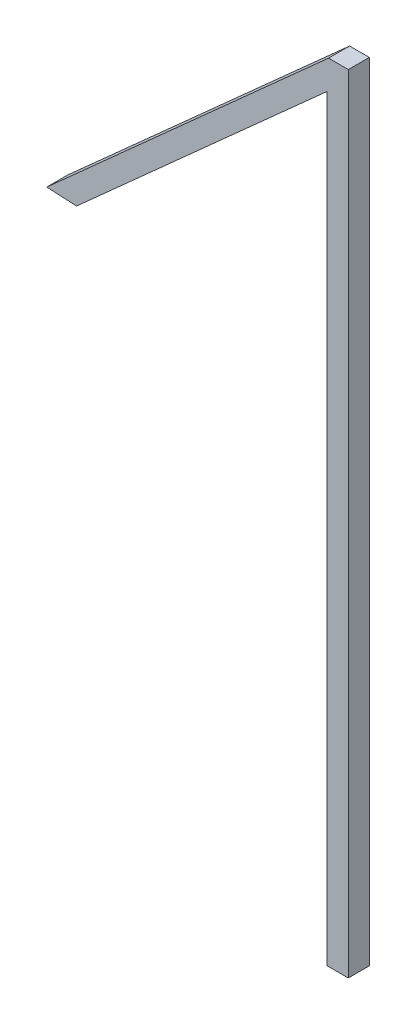
ISO-10303-21;
HEADER;
FILE_DESCRIPTION(('STEP AP214'),'2;1');
FILE_NAME('part.step','',(''),(''),'','','');
FILE_SCHEMA(('AUTOMOTIVE_DESIGN { 1 0 10303 214 1 1 1 1 }'));
ENDSEC;
DATA;
#1=APPLICATION_CONTEXT('core data for automotive mechanical design processes');
#2=APPLICATION_PROTOCOL_DEFINITION('international standard','automotive_design',2000,#1);
#3=PRODUCT_CONTEXT('',#1,'mechanical');
#4=PRODUCT('Part','Part','',(#3));
#5=PRODUCT_RELATED_PRODUCT_CATEGORY('part','',(#4));
#6=PRODUCT_DEFINITION_FORMATION('','',#4);
#7=PRODUCT_DEFINITION_CONTEXT('part definition',#1,'design');
#8=PRODUCT_DEFINITION('design','',#6,#7);
#9=PRODUCT_DEFINITION_SHAPE('','',#8);
#10=(LENGTH_UNIT() NAMED_UNIT(*) SI_UNIT(.MILLI.,.METRE.));
#11=(NAMED_UNIT(*) PLANE_ANGLE_UNIT() SI_UNIT($,.RADIAN.));
#12=(NAMED_UNIT(*) SI_UNIT($,.STERADIAN.) SOLID_ANGLE_UNIT());
#13=UNCERTAINTY_MEASURE_WITH_UNIT(LENGTH_MEASURE(1.E-05),#10,'distance_accuracy_value','');
#14=(GEOMETRIC_REPRESENTATION_CONTEXT(3) GLOBAL_UNCERTAINTY_ASSIGNED_CONTEXT((#13)) GLOBAL_UNIT_ASSIGNED_CONTEXT((#10,
#11,#12)) REPRESENTATION_CONTEXT('',''));
#15=CARTESIAN_POINT('',(0.,0.,0.));
#16=DIRECTION('',(0.,0.,1.));
#17=DIRECTION('',(1.,0.,0.));
#18=AXIS2_PLACEMENT_3D('',#15,#16,#17);
#19=CARTESIAN_POINT('',(0.,19.3962732825144,0.5));
#20=DIRECTION('',(0.0488801864381727,0.998804649255183,0.));
#21=DIRECTION('',(-0.998804649255183,0.0488801864381727,0.));
#22=AXIS2_PLACEMENT_3D('',#19,#20,#21);
#23=PLANE('',#22);
#24=DIRECTION('',(0.998804649255183,-0.0488801864381727,0.));
#25=VECTOR('',#24,1.);
#26=CARTESIAN_POINT('',(0.,19.3962732825144,0.));
#27=LINE('',#26,#25);
#28=CARTESIAN_POINT('',(0.,19.3962732825144,0.));
#29=VERTEX_POINT('',#28);
#30=CARTESIAN_POINT('',(0.710413851692346,19.3615065625709,0.));
#31=VERTEX_POINT('',#30);
#32=EDGE_CURVE('E123',#29,#31,#27,.T.);
#33=ORIENTED_EDGE('',*,*,#32,.T.);
#34=DIRECTION('',(0.,0.,-1.));
#35=VECTOR('',#34,1.);
#36=CARTESIAN_POINT('',(0.710413851692346,19.3615065625709,0.5));
#37=LINE('',#36,#35);
#38=CARTESIAN_POINT('',(0.710413851692346,19.3615065625709,0.5));
#39=VERTEX_POINT('',#38);
#40=EDGE_CURVE('E11',#39,#31,#37,.T.);
#41=ORIENTED_EDGE('',*,*,#40,.F.);
#42=DIRECTION('',(0.998804649255183,-0.0488801864381727,0.));
#43=VECTOR('',#42,1.);
#44=CARTESIAN_POINT('',(0.,19.3962732825144,0.5));
#45=LINE('',#44,#43);
#46=CARTESIAN_POINT('',(0.,19.3962732825144,0.5));
#47=VERTEX_POINT('',#46);
#48=EDGE_CURVE('E135',#47,#39,#45,.T.);
#49=ORIENTED_EDGE('',*,*,#48,.F.);
#50=DIRECTION('',(0.,0.,-1.));
#51=VECTOR('',#50,1.);
#52=CARTESIAN_POINT('',(0.,19.3962732825144,0.5));
#53=LINE('',#52,#51);
#54=EDGE_CURVE('E119',#47,#29,#53,.T.);
#55=ORIENTED_EDGE('',*,*,#54,.T.);
#56=EDGE_LOOP('',(#33,#41,#49,#55));
#57=FACE_BOUND('',#56,.T.);
#58=ADVANCED_FACE('F33',(#57),#23,.F.);
#59=CARTESIAN_POINT('',(0.710413851692346,19.3615065625709,0.5));
#60=DIRECTION('',(-0.667369141114597,0.744727083895816,0.));
#61=DIRECTION('',(-0.744727083895816,-0.667369141114597,0.));
#62=AXIS2_PLACEMENT_3D('',#59,#60,#61);
#63=PLANE('',#62);
#64=DIRECTION('',(0.744727083895816,0.667369141114597,0.));
#65=VECTOR('',#64,1.);
#66=CARTESIAN_POINT('',(0.710413851692346,19.3615065625709,0.));
#67=LINE('',#66,#65);
#68=CARTESIAN_POINT('',(6.66823052285887,24.7004596914876,0.));
#69=VERTEX_POINT('',#68);
#70=EDGE_CURVE('E126',#31,#69,#67,.T.);
#71=ORIENTED_EDGE('',*,*,#70,.T.);
#72=DIRECTION('',(0.,0.,-1.));
#73=VECTOR('',#72,1.);
#74=CARTESIAN_POINT('',(6.66823052285887,24.7004596914876,0.5));
#75=LINE('',#74,#73);
#76=CARTESIAN_POINT('',(6.66823052285887,24.7004596914876,0.5));
#77=VERTEX_POINT('',#76);
#78=EDGE_CURVE('E41',#77,#69,#75,.T.);
#79=ORIENTED_EDGE('',*,*,#78,.F.);
#80=DIRECTION('',(0.744727083895816,0.667369141114597,0.));
#81=VECTOR('',#80,1.);
#82=CARTESIAN_POINT('',(0.710413851692346,19.3615065625709,0.5));
#83=LINE('',#82,#81);
#84=EDGE_CURVE('E89',#39,#77,#83,.T.);
#85=ORIENTED_EDGE('',*,*,#84,.F.);
#86=ORIENTED_EDGE('',*,*,#40,.T.);
#87=EDGE_LOOP('',(#71,#79,#85,#86));
#88=FACE_BOUND('',#87,.T.);
#89=ADVANCED_FACE('F160',(#88),#63,.F.);
#90=CARTESIAN_POINT('',(6.66823052285887,24.7004596914876,0.5));
#91=DIRECTION('',(1.,0.,0.));
#92=DIRECTION('',(0.,1.,0.));
#93=AXIS2_PLACEMENT_3D('',#90,#91,#92);
#94=PLANE('',#93);
#95=DIRECTION('',(0.,-1.,0.));
#96=VECTOR('',#95,1.);
#97=CARTESIAN_POINT('',(6.66823052285887,24.7004596914876,0.));
#98=LINE('',#97,#96);
#99=CARTESIAN_POINT('',(6.66823052285887,6.70045969148764,0.));
#100=VERTEX_POINT('',#99);
#101=EDGE_CURVE('E128',#69,#100,#98,.T.);
#102=ORIENTED_EDGE('',*,*,#101,.T.);
#103=DIRECTION('',(0.,0.,-1.));
#104=VECTOR('',#103,1.);
#105=CARTESIAN_POINT('',(6.66823052285887,6.70045969148764,0.5));
#106=LINE('',#105,#104);
#107=CARTESIAN_POINT('',(6.66823052285887,6.70045969148764,0.5));
#108=VERTEX_POINT('',#107);
#109=EDGE_CURVE('E139',#108,#100,#106,.T.);
#110=ORIENTED_EDGE('',*,*,#109,.F.);
#111=DIRECTION('',(0.,-1.,0.));
#112=VECTOR('',#111,1.);
#113=CARTESIAN_POINT('',(6.66823052285887,24.7004596914876,0.5));
#114=LINE('',#113,#112);
#115=EDGE_CURVE('E147',#77,#108,#114,.T.);
#116=ORIENTED_EDGE('',*,*,#115,.F.);
#117=ORIENTED_EDGE('',*,*,#78,.T.);
#118=EDGE_LOOP('',(#102,#110,#116,#117));
#119=FACE_BOUND('',#118,.T.);
#120=ADVANCED_FACE('F145',(#119),#94,.F.);
#121=CARTESIAN_POINT('',(6.66823052285887,6.70045969148764,0.5));
#122=DIRECTION('',(0.,1.,0.));
#123=DIRECTION('',(0.,0.,1.));
#124=AXIS2_PLACEMENT_3D('',#121,#122,#123);
#125=PLANE('',#124);
#126=DIRECTION('',(1.,0.,0.));
#127=VECTOR('',#126,1.);
#128=CARTESIAN_POINT('',(6.66823052285887,6.70045969148764,0.));
#129=LINE('',#128,#127);
#130=CARTESIAN_POINT('',(7.16823052285887,6.70045969148764,0.));
#131=VERTEX_POINT('',#130);
#132=EDGE_CURVE('E130',#100,#131,#129,.T.);
#133=ORIENTED_EDGE('',*,*,#132,.T.);
#134=DIRECTION('',(0.,0.,-1.));
#135=VECTOR('',#134,1.);
#136=CARTESIAN_POINT('',(7.16823052285887,6.70045969148764,0.5));
#137=LINE('',#136,#135);
#138=CARTESIAN_POINT('',(7.16823052285887,6.70045969148764,0.5));
#139=VERTEX_POINT('',#138);
#140=EDGE_CURVE('E114',#139,#131,#137,.T.);
#141=ORIENTED_EDGE('',*,*,#140,.F.);
#142=DIRECTION('',(1.,0.,0.));
#143=VECTOR('',#142,1.);
#144=CARTESIAN_POINT('',(6.66823052285887,6.70045969148764,0.5));
#145=LINE('',#144,#143);
#146=EDGE_CURVE('E105',#108,#139,#145,.T.);
#147=ORIENTED_EDGE('',*,*,#146,.F.);
#148=ORIENTED_EDGE('',*,*,#109,.T.);
#149=EDGE_LOOP('',(#133,#141,#147,#148));
#150=FACE_BOUND('',#149,.T.);
#151=ADVANCED_FACE('F153',(#150),#125,.F.);
#152=CARTESIAN_POINT('',(7.16823052285887,6.70045969148764,0.5));
#153=DIRECTION('',(-1.,0.,0.));
#154=DIRECTION('',(0.,0.,1.));
#155=AXIS2_PLACEMENT_3D('',#152,#153,#154);
#156=PLANE('',#155);
#157=DIRECTION('',(0.,1.,0.));
#158=VECTOR('',#157,1.);
#159=CARTESIAN_POINT('',(7.16823052285887,6.70045969148764,0.));
#160=LINE('',#159,#158);
#161=CARTESIAN_POINT('',(7.16823052285887,25.3999967911118,0.));
#162=VERTEX_POINT('',#161);
#163=EDGE_CURVE('E113',#131,#162,#160,.T.);
#164=ORIENTED_EDGE('',*,*,#163,.T.);
#165=DIRECTION('',(0.,0.,-1.));
#166=VECTOR('',#165,1.);
#167=CARTESIAN_POINT('',(7.16823052285887,25.3999967911118,0.5));
#168=LINE('',#167,#166);
#169=CARTESIAN_POINT('',(7.16823052285887,25.3999967911118,0.5));
#170=VERTEX_POINT('',#169);
#171=EDGE_CURVE('E110',#170,#162,#168,.T.);
#172=ORIENTED_EDGE('',*,*,#171,.F.);
#173=DIRECTION('',(0.,1.,0.));
#174=VECTOR('',#173,1.);
#175=CARTESIAN_POINT('',(7.16823052285887,6.70045969148764,0.5));
#176=LINE('',#175,#174);
#177=EDGE_CURVE('E99',#139,#170,#176,.T.);
#178=ORIENTED_EDGE('',*,*,#177,.F.);
#179=ORIENTED_EDGE('',*,*,#140,.T.);
#180=EDGE_LOOP('',(#164,#172,#178,#179));
#181=FACE_BOUND('',#180,.T.);
#182=ADVANCED_FACE('F111',(#181),#156,.F.);
#183=CARTESIAN_POINT('',(7.16823052285887,25.3999967911118,0.5));
#184=DIRECTION('',(0.,-1.,0.));
#185=DIRECTION('',(0.,0.,-1.));
#186=AXIS2_PLACEMENT_3D('',#183,#184,#185);
#187=PLANE('',#186);
#188=DIRECTION('',(-1.,0.,0.));
#189=VECTOR('',#188,1.);
#190=CARTESIAN_POINT('',(7.16823052285887,25.3999967911118,0.));
#191=LINE('',#190,#189);
#192=CARTESIAN_POINT('',(6.69964375878557,25.3999967911118,0.));
#193=VERTEX_POINT('',#192);
#194=EDGE_CURVE('E75',#162,#193,#191,.T.);
#195=ORIENTED_EDGE('',*,*,#194,.T.);
#196=DIRECTION('',(0.,0.,-1.));
#197=VECTOR('',#196,1.);
#198=CARTESIAN_POINT('',(6.69964375878557,25.3999967911118,0.5));
#199=LINE('',#198,#197);
#200=CARTESIAN_POINT('',(6.69964375878557,25.3999967911118,0.5));
#201=VERTEX_POINT('',#200);
#202=EDGE_CURVE('E115',#201,#193,#199,.T.);
#203=ORIENTED_EDGE('',*,*,#202,.F.);
#204=DIRECTION('',(-1.,0.,0.));
#205=VECTOR('',#204,1.);
#206=CARTESIAN_POINT('',(7.16823052285887,25.3999967911118,0.5));
#207=LINE('',#206,#205);
#208=EDGE_CURVE('E103',#170,#201,#207,.T.);
#209=ORIENTED_EDGE('',*,*,#208,.F.);
#210=ORIENTED_EDGE('',*,*,#171,.T.);
#211=EDGE_LOOP('',(#195,#203,#209,#210));
#212=FACE_BOUND('',#211,.T.);
#213=ADVANCED_FACE('F117',(#212),#187,.F.);
#214=CARTESIAN_POINT('',(6.69964375878557,25.3999967911118,0.5));
#215=DIRECTION('',(0.667369141114597,-0.744727083895815,0.));
#216=DIRECTION('',(0.744727083895815,0.667369141114597,0.));
#217=AXIS2_PLACEMENT_3D('',#214,#215,#216);
#218=PLANE('',#217);
#219=DIRECTION('',(-0.744727083895815,-0.667369141114597,0.));
#220=VECTOR('',#219,1.);
#221=CARTESIAN_POINT('',(6.69964375878557,25.3999967911118,0.));
#222=LINE('',#221,#220);
#223=EDGE_CURVE('E81',#193,#29,#222,.T.);
#224=ORIENTED_EDGE('',*,*,#223,.T.);
#225=ORIENTED_EDGE('',*,*,#54,.F.);
#226=DIRECTION('',(-0.744727083895815,-0.667369141114597,0.));
#227=VECTOR('',#226,1.);
#228=CARTESIAN_POINT('',(6.69964375878557,25.3999967911118,0.5));
#229=LINE('',#228,#227);
#230=EDGE_CURVE('E49',#201,#47,#229,.T.);
#231=ORIENTED_EDGE('',*,*,#230,.F.);
#232=ORIENTED_EDGE('',*,*,#202,.T.);
#233=EDGE_LOOP('',(#224,#225,#231,#232));
#234=FACE_BOUND('',#233,.T.);
#235=ADVANCED_FACE('F174',(#234),#218,.F.);
#236=CARTESIAN_POINT('',(0.,0.,0.5));
#237=DIRECTION('',(0.,0.,-1.));
#238=DIRECTION('',(-1.,0.,0.));
#239=AXIS2_PLACEMENT_3D('',#236,#237,#238);
#240=PLANE('',#239);
#241=ORIENTED_EDGE('',*,*,#48,.T.);
#242=ORIENTED_EDGE('',*,*,#84,.T.);
#243=ORIENTED_EDGE('',*,*,#115,.T.);
#244=ORIENTED_EDGE('',*,*,#146,.T.);
#245=ORIENTED_EDGE('',*,*,#177,.T.);
#246=ORIENTED_EDGE('',*,*,#208,.T.);
#247=ORIENTED_EDGE('',*,*,#230,.T.);
#248=EDGE_LOOP('',(#241,#242,#243,#244,#245,#246,#247));
#249=FACE_BOUND('',#248,.T.);
#250=ADVANCED_FACE('F101',(#249),#240,.F.);
#251=CARTESIAN_POINT('',(0.,0.,0.));
#252=DIRECTION('',(0.,0.,-1.));
#253=DIRECTION('',(-1.,0.,0.));
#254=AXIS2_PLACEMENT_3D('',#251,#252,#253);
#255=PLANE('',#254);
#256=ORIENTED_EDGE('',*,*,#32,.F.);
#257=ORIENTED_EDGE('',*,*,#223,.F.);
#258=ORIENTED_EDGE('',*,*,#194,.F.);
#259=ORIENTED_EDGE('',*,*,#163,.F.);
#260=ORIENTED_EDGE('',*,*,#132,.F.);
#261=ORIENTED_EDGE('',*,*,#101,.F.);
#262=ORIENTED_EDGE('',*,*,#70,.F.);
#263=EDGE_LOOP('',(#256,#257,#258,#259,#260,#261,#262));
#264=FACE_BOUND('',#263,.T.);
#265=ADVANCED_FACE('F151',(#264),#255,.T.);
#266=CLOSED_SHELL('',(#58,#89,#120,#151,#182,#213,#235,#250,#265));
#267=MANIFOLD_SOLID_BREP('B2',#266);
#268=ADVANCED_BREP_SHAPE_REPRESENTATION('',(#18,#267),#14);
#269=SHAPE_DEFINITION_REPRESENTATION(#9,#268);
ENDSEC;
END-ISO-10303-21;
